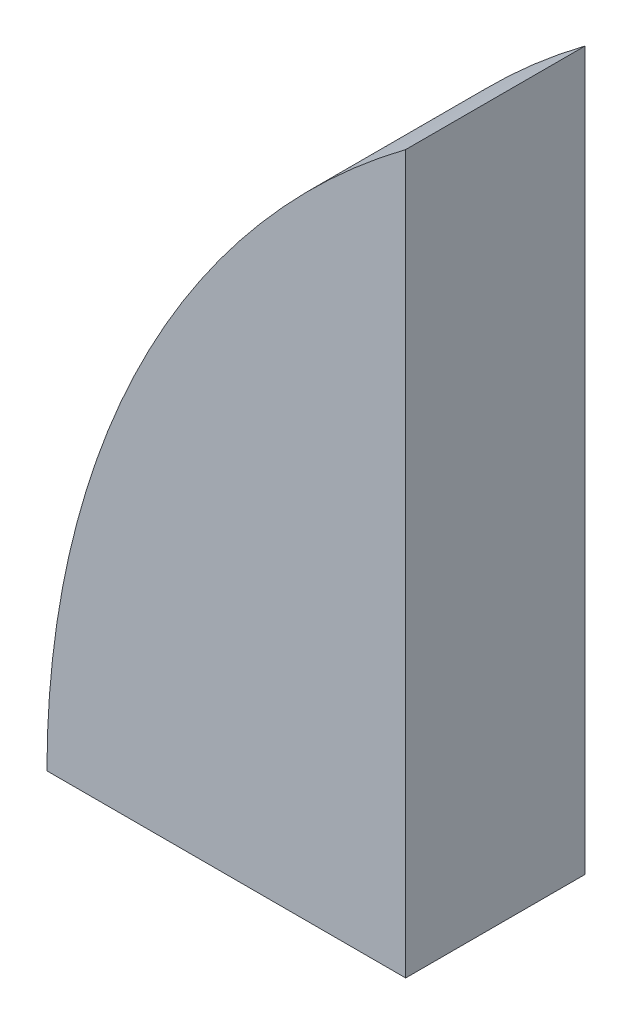
ISO-10303-21;
HEADER;
FILE_DESCRIPTION(('STEP AP214'),'2;1');
FILE_NAME('part.step','',(''),(''),'','','');
FILE_SCHEMA(('AUTOMOTIVE_DESIGN { 1 0 10303 214 1 1 1 1 }'));
ENDSEC;
DATA;
#1=APPLICATION_CONTEXT('core data for automotive mechanical design processes');
#2=APPLICATION_PROTOCOL_DEFINITION('international standard','automotive_design',2000,#1);
#3=PRODUCT_CONTEXT('',#1,'mechanical');
#4=PRODUCT('Part','Part','',(#3));
#5=PRODUCT_RELATED_PRODUCT_CATEGORY('part','',(#4));
#6=PRODUCT_DEFINITION_FORMATION('','',#4);
#7=PRODUCT_DEFINITION_CONTEXT('part definition',#1,'design');
#8=PRODUCT_DEFINITION('design','',#6,#7);
#9=PRODUCT_DEFINITION_SHAPE('','',#8);
#10=(LENGTH_UNIT() NAMED_UNIT(*) SI_UNIT(.MILLI.,.METRE.));
#11=(NAMED_UNIT(*) PLANE_ANGLE_UNIT() SI_UNIT($,.RADIAN.));
#12=(NAMED_UNIT(*) SI_UNIT($,.STERADIAN.) SOLID_ANGLE_UNIT());
#13=UNCERTAINTY_MEASURE_WITH_UNIT(LENGTH_MEASURE(1.E-05),#10,'distance_accuracy_value','');
#14=(GEOMETRIC_REPRESENTATION_CONTEXT(3) GLOBAL_UNCERTAINTY_ASSIGNED_CONTEXT((#13)) GLOBAL_UNIT_ASSIGNED_CONTEXT((#10,
#11,#12)) REPRESENTATION_CONTEXT('',''));
#15=CARTESIAN_POINT('',(0.,0.,0.));
#16=DIRECTION('',(0.,0.,1.));
#17=DIRECTION('',(1.,0.,0.));
#18=AXIS2_PLACEMENT_3D('',#15,#16,#17);
#19=CARTESIAN_POINT('',(31.75,12.7,6.35));
#20=DIRECTION('',(0.,0.,-1.));
#21=DIRECTION('',(-1.,0.,0.));
#22=AXIS2_PLACEMENT_3D('',#19,#20,#21);
#23=CYLINDRICAL_SURFACE('',#22,31.75);
#24=CARTESIAN_POINT('',(31.75,12.7,0.));
#25=DIRECTION('',(0.,0.,1.));
#26=DIRECTION('',(1.,0.,0.));
#27=AXIS2_PLACEMENT_3D('',#24,#25,#26);
#28=CIRCLE('',#27,31.75);
#29=CARTESIAN_POINT('',(0.,12.7,0.));
#30=VERTEX_POINT('',#29);
#31=CARTESIAN_POINT('',(12.7,38.1,0.));
#32=VERTEX_POINT('',#31);
#33=EDGE_CURVE('E75',#30,#32,#28,.F.);
#34=ORIENTED_EDGE('',*,*,#33,.F.);
#35=DIRECTION('',(0.,0.,-1.));
#36=VECTOR('',#35,1.);
#37=CARTESIAN_POINT('',(0.,12.7,6.35));
#38=LINE('',#37,#36);
#39=CARTESIAN_POINT('',(0.,12.7,6.35));
#40=VERTEX_POINT('',#39);
#41=EDGE_CURVE('E11',#40,#30,#38,.T.);
#42=ORIENTED_EDGE('',*,*,#41,.F.);
#43=CARTESIAN_POINT('',(31.75,12.7,6.35));
#44=DIRECTION('',(0.,0.,1.));
#45=DIRECTION('',(1.,0.,0.));
#46=AXIS2_PLACEMENT_3D('',#43,#44,#45);
#47=CIRCLE('',#46,31.75);
#48=CARTESIAN_POINT('',(12.7,38.1,6.35));
#49=VERTEX_POINT('',#48);
#50=EDGE_CURVE('E73',#40,#49,#47,.F.);
#51=ORIENTED_EDGE('',*,*,#50,.T.);
#52=DIRECTION('',(0.,0.,-1.));
#53=VECTOR('',#52,1.);
#54=CARTESIAN_POINT('',(12.7,38.1,6.35));
#55=LINE('',#54,#53);
#56=EDGE_CURVE('E69',#49,#32,#55,.T.);
#57=ORIENTED_EDGE('',*,*,#56,.T.);
#58=EDGE_LOOP('',(#34,#42,#51,#57));
#59=FACE_BOUND('',#58,.T.);
#60=ADVANCED_FACE('F35',(#59),#23,.T.);
#61=CARTESIAN_POINT('',(0.,12.7,6.35));
#62=DIRECTION('',(0.,1.,0.));
#63=DIRECTION('',(-1.,0.,0.));
#64=AXIS2_PLACEMENT_3D('',#61,#62,#63);
#65=PLANE('',#64);
#66=DIRECTION('',(1.,0.,0.));
#67=VECTOR('',#66,1.);
#68=CARTESIAN_POINT('',(0.,12.7,0.));
#69=LINE('',#68,#67);
#70=CARTESIAN_POINT('',(12.7,12.7,0.));
#71=VERTEX_POINT('',#70);
#72=EDGE_CURVE('E63',#30,#71,#69,.T.);
#73=ORIENTED_EDGE('',*,*,#72,.T.);
#74=DIRECTION('',(0.,0.,-1.));
#75=VECTOR('',#74,1.);
#76=CARTESIAN_POINT('',(12.7,12.7,6.35));
#77=LINE('',#76,#75);
#78=CARTESIAN_POINT('',(12.7,12.7,6.35));
#79=VERTEX_POINT('',#78);
#80=EDGE_CURVE('E43',#79,#71,#77,.T.);
#81=ORIENTED_EDGE('',*,*,#80,.F.);
#82=DIRECTION('',(1.,0.,0.));
#83=VECTOR('',#82,1.);
#84=CARTESIAN_POINT('',(0.,12.7,6.35));
#85=LINE('',#84,#83);
#86=EDGE_CURVE('E76',#40,#79,#85,.T.);
#87=ORIENTED_EDGE('',*,*,#86,.F.);
#88=ORIENTED_EDGE('',*,*,#41,.T.);
#89=EDGE_LOOP('',(#73,#81,#87,#88));
#90=FACE_BOUND('',#89,.T.);
#91=ADVANCED_FACE('F77',(#90),#65,.F.);
#92=CARTESIAN_POINT('',(12.7,0.,6.35));
#93=DIRECTION('',(-1.,0.,0.));
#94=DIRECTION('',(0.,0.,1.));
#95=AXIS2_PLACEMENT_3D('',#92,#93,#94);
#96=PLANE('',#95);
#97=DIRECTION('',(0.,1.,0.));
#98=VECTOR('',#97,1.);
#99=CARTESIAN_POINT('',(12.7,0.,0.));
#100=LINE('',#99,#98);
#101=EDGE_CURVE('E80',#71,#32,#100,.T.);
#102=ORIENTED_EDGE('',*,*,#101,.T.);
#103=ORIENTED_EDGE('',*,*,#56,.F.);
#104=DIRECTION('',(0.,1.,0.));
#105=VECTOR('',#104,1.);
#106=CARTESIAN_POINT('',(12.7,0.,6.35));
#107=LINE('',#106,#105);
#108=EDGE_CURVE('E51',#79,#49,#107,.T.);
#109=ORIENTED_EDGE('',*,*,#108,.F.);
#110=ORIENTED_EDGE('',*,*,#80,.T.);
#111=EDGE_LOOP('',(#102,#103,#109,#110));
#112=FACE_BOUND('',#111,.T.);
#113=ADVANCED_FACE('F89',(#112),#96,.F.);
#114=CARTESIAN_POINT('',(0.,0.,6.35));
#115=DIRECTION('',(0.,0.,1.));
#116=DIRECTION('',(1.,0.,0.));
#117=AXIS2_PLACEMENT_3D('',#114,#115,#116);
#118=PLANE('',#117);
#119=ORIENTED_EDGE('',*,*,#50,.F.);
#120=ORIENTED_EDGE('',*,*,#86,.T.);
#121=ORIENTED_EDGE('',*,*,#108,.T.);
#122=EDGE_LOOP('',(#119,#120,#121));
#123=FACE_BOUND('',#122,.T.);
#124=ADVANCED_FACE('F79',(#123),#118,.T.);
#125=CARTESIAN_POINT('',(0.,0.,0.));
#126=DIRECTION('',(0.,0.,1.));
#127=DIRECTION('',(1.,0.,0.));
#128=AXIS2_PLACEMENT_3D('',#125,#126,#127);
#129=PLANE('',#128);
#130=ORIENTED_EDGE('',*,*,#33,.T.);
#131=ORIENTED_EDGE('',*,*,#101,.F.);
#132=ORIENTED_EDGE('',*,*,#72,.F.);
#133=EDGE_LOOP('',(#130,#131,#132));
#134=FACE_BOUND('',#133,.T.);
#135=ADVANCED_FACE('F91',(#134),#129,.F.);
#136=CLOSED_SHELL('',(#60,#91,#113,#124,#135));
#137=MANIFOLD_SOLID_BREP('B2',#136);
#138=ADVANCED_BREP_SHAPE_REPRESENTATION('',(#18,#137),#14);
#139=SHAPE_DEFINITION_REPRESENTATION(#9,#138);
ENDSEC;
END-ISO-10303-21;
